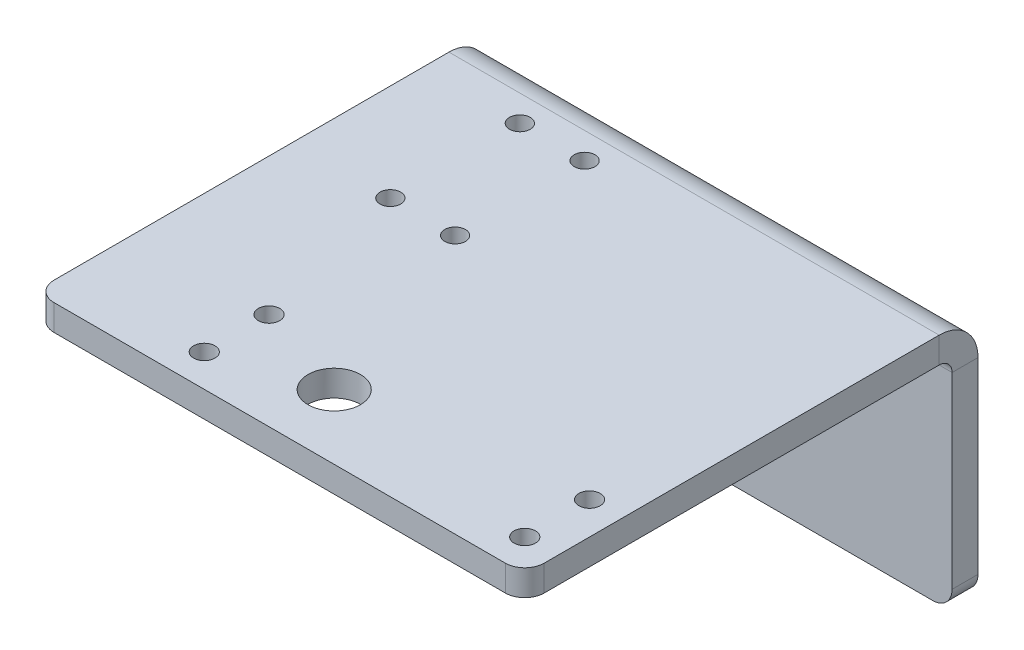
ISO-10303-21;
HEADER;
FILE_DESCRIPTION(('STEP AP214'),'2;1');
FILE_NAME('part.step','',(''),(''),'','','');
FILE_SCHEMA(('AUTOMOTIVE_DESIGN { 1 0 10303 214 1 1 1 1 }'));
ENDSEC;
DATA;
#1=APPLICATION_CONTEXT('core data for automotive mechanical design processes');
#2=APPLICATION_PROTOCOL_DEFINITION('international standard','automotive_design',2000,#1);
#3=PRODUCT_CONTEXT('',#1,'mechanical');
#4=PRODUCT('Part','Part','',(#3));
#5=PRODUCT_RELATED_PRODUCT_CATEGORY('part','',(#4));
#6=PRODUCT_DEFINITION_FORMATION('','',#4);
#7=PRODUCT_DEFINITION_CONTEXT('part definition',#1,'design');
#8=PRODUCT_DEFINITION('design','',#6,#7);
#9=PRODUCT_DEFINITION_SHAPE('','',#8);
#10=(LENGTH_UNIT() NAMED_UNIT(*) SI_UNIT(.MILLI.,.METRE.));
#11=(NAMED_UNIT(*) PLANE_ANGLE_UNIT() SI_UNIT($,.RADIAN.));
#12=(NAMED_UNIT(*) SI_UNIT($,.STERADIAN.) SOLID_ANGLE_UNIT());
#13=UNCERTAINTY_MEASURE_WITH_UNIT(LENGTH_MEASURE(1.E-05),#10,'distance_accuracy_value','');
#14=(GEOMETRIC_REPRESENTATION_CONTEXT(3) GLOBAL_UNCERTAINTY_ASSIGNED_CONTEXT((#13)) GLOBAL_UNIT_ASSIGNED_CONTEXT((#10,
#11,#12)) REPRESENTATION_CONTEXT('',''));
#15=CARTESIAN_POINT('',(0.,0.,0.));
#16=DIRECTION('',(0.,0.,1.));
#17=DIRECTION('',(1.,0.,0.));
#18=AXIS2_PLACEMENT_3D('',#15,#16,#17);
#19=CARTESIAN_POINT('',(75.71,0.,3.));
#20=DIRECTION('',(1.,0.,0.));
#21=DIRECTION('',(0.,1.,0.));
#22=AXIS2_PLACEMENT_3D('',#19,#20,#21);
#23=PLANE('',#22);
#24=DIRECTION('',(0.,1.,0.));
#25=VECTOR('',#24,1.);
#26=CARTESIAN_POINT('',(75.71,0.,3.));
#27=LINE('',#26,#25);
#28=CARTESIAN_POINT('',(75.71,-29.,3.));
#29=VERTEX_POINT('',#28);
#30=CARTESIAN_POINT('',(75.71,0.,3.));
#31=VERTEX_POINT('',#30);
#32=EDGE_CURVE('E214',#29,#31,#27,.T.);
#33=ORIENTED_EDGE('',*,*,#32,.F.);
#34=DIRECTION('',(0.,0.,1.));
#35=VECTOR('',#34,1.);
#36=CARTESIAN_POINT('',(75.71,-29.,3.));
#37=LINE('',#36,#35);
#38=CARTESIAN_POINT('',(75.71,-29.,-1.));
#39=VERTEX_POINT('',#38);
#40=EDGE_CURVE('E273',#29,#39,#37,.F.);
#41=ORIENTED_EDGE('',*,*,#40,.T.);
#42=DIRECTION('',(0.,1.,0.));
#43=VECTOR('',#42,1.);
#44=CARTESIAN_POINT('',(75.71,0.,-1.));
#45=LINE('',#44,#43);
#46=CARTESIAN_POINT('',(75.71,0.,-1.));
#47=VERTEX_POINT('',#46);
#48=EDGE_CURVE('E237',#39,#47,#45,.T.);
#49=ORIENTED_EDGE('',*,*,#48,.T.);
#50=DIRECTION('',(0.,0.,1.));
#51=VECTOR('',#50,1.);
#52=CARTESIAN_POINT('',(75.71,0.,3.));
#53=LINE('',#52,#51);
#54=EDGE_CURVE('E246',#47,#31,#53,.T.);
#55=ORIENTED_EDGE('',*,*,#54,.T.);
#56=EDGE_LOOP('',(#33,#41,#49,#55));
#57=FACE_BOUND('',#56,.T.);
#58=ADVANCED_FACE('F57',(#57),#23,.T.);
#59=CARTESIAN_POINT('',(0.,0.,3.));
#60=DIRECTION('',(-1.,0.,0.));
#61=DIRECTION('',(0.,-1.,0.));
#62=AXIS2_PLACEMENT_3D('',#59,#60,#61);
#63=PLANE('',#62);
#64=DIRECTION('',(0.,1.,0.));
#65=VECTOR('',#64,1.);
#66=CARTESIAN_POINT('',(0.,0.,-1.));
#67=LINE('',#66,#65);
#68=CARTESIAN_POINT('',(0.,0.,-1.));
#69=VERTEX_POINT('',#68);
#70=CARTESIAN_POINT('',(0.,-29.,-1.));
#71=VERTEX_POINT('',#70);
#72=EDGE_CURVE('E231',#69,#71,#67,.F.);
#73=ORIENTED_EDGE('',*,*,#72,.T.);
#74=DIRECTION('',(0.,0.,1.));
#75=VECTOR('',#74,1.);
#76=CARTESIAN_POINT('',(0.,-29.,3.));
#77=LINE('',#76,#75);
#78=CARTESIAN_POINT('',(0.,-29.,3.));
#79=VERTEX_POINT('',#78);
#80=EDGE_CURVE('E279',#71,#79,#77,.T.);
#81=ORIENTED_EDGE('',*,*,#80,.T.);
#82=DIRECTION('',(0.,-1.,0.));
#83=VECTOR('',#82,1.);
#84=CARTESIAN_POINT('',(0.,0.,3.));
#85=LINE('',#84,#83);
#86=CARTESIAN_POINT('',(0.,0.,3.));
#87=VERTEX_POINT('',#86);
#88=EDGE_CURVE('E208',#87,#79,#85,.T.);
#89=ORIENTED_EDGE('',*,*,#88,.F.);
#90=DIRECTION('',(0.,0.,1.));
#91=VECTOR('',#90,1.);
#92=CARTESIAN_POINT('',(0.,0.,3.));
#93=LINE('',#92,#91);
#94=EDGE_CURVE('E225',#69,#87,#93,.T.);
#95=ORIENTED_EDGE('',*,*,#94,.F.);
#96=EDGE_LOOP('',(#73,#81,#89,#95));
#97=FACE_BOUND('',#96,.T.);
#98=ADVANCED_FACE('F329',(#97),#63,.T.);
#99=CARTESIAN_POINT('',(16.,-25.0000000000001,3.));
#100=DIRECTION('',(0.,0.,1.));
#101=DIRECTION('',(1.,0.,0.));
#102=AXIS2_PLACEMENT_3D('',#99,#100,#101);
#103=CYLINDRICAL_SURFACE('',#102,1.6);
#104=CARTESIAN_POINT('',(16.,-25.0000000000001,3.));
#105=DIRECTION('',(0.,0.,1.));
#106=DIRECTION('',(1.,0.,0.));
#107=AXIS2_PLACEMENT_3D('',#104,#105,#106);
#108=CIRCLE('',#107,1.6);
#109=CARTESIAN_POINT('',(17.6,-25.0000000000001,3.));
#110=VERTEX_POINT('',#109);
#111=EDGE_CURVE('E201',#110,#110,#108,.T.);
#112=ORIENTED_EDGE('',*,*,#111,.T.);
#113=EDGE_LOOP('',(#112));
#114=FACE_BOUND('',#113,.T.);
#115=CARTESIAN_POINT('',(16.,-25.0000000000001,-1.));
#116=DIRECTION('',(0.,0.,1.));
#117=DIRECTION('',(1.,0.,0.));
#118=AXIS2_PLACEMENT_3D('',#115,#116,#117);
#119=CIRCLE('',#118,1.6);
#120=CARTESIAN_POINT('',(17.6,-25.0000000000001,-1.));
#121=VERTEX_POINT('',#120);
#122=EDGE_CURVE('E196',#121,#121,#119,.T.);
#123=ORIENTED_EDGE('',*,*,#122,.F.);
#124=EDGE_LOOP('',(#123));
#125=FACE_BOUND('',#124,.T.);
#126=ADVANCED_FACE('F355',(#114,#125),#103,.F.);
#127=CARTESIAN_POINT('',(36.,-5.,3.));
#128=DIRECTION('',(0.,0.,1.));
#129=DIRECTION('',(1.,0.,0.));
#130=AXIS2_PLACEMENT_3D('',#127,#128,#129);
#131=CYLINDRICAL_SURFACE('',#130,1.60000000000001);
#132=CARTESIAN_POINT('',(36.,-5.,3.));
#133=DIRECTION('',(0.,0.,1.));
#134=DIRECTION('',(1.,0.,0.));
#135=AXIS2_PLACEMENT_3D('',#132,#133,#134);
#136=CIRCLE('',#135,1.60000000000001);
#137=CARTESIAN_POINT('',(37.6,-5.,3.));
#138=VERTEX_POINT('',#137);
#139=EDGE_CURVE('E204',#138,#138,#136,.T.);
#140=ORIENTED_EDGE('',*,*,#139,.T.);
#141=EDGE_LOOP('',(#140));
#142=FACE_BOUND('',#141,.T.);
#143=CARTESIAN_POINT('',(36.,-5.,-1.));
#144=DIRECTION('',(0.,0.,1.));
#145=DIRECTION('',(1.,0.,0.));
#146=AXIS2_PLACEMENT_3D('',#143,#144,#145);
#147=CIRCLE('',#146,1.60000000000001);
#148=CARTESIAN_POINT('',(37.6,-5.,-1.));
#149=VERTEX_POINT('',#148);
#150=EDGE_CURVE('E228',#149,#149,#147,.T.);
#151=ORIENTED_EDGE('',*,*,#150,.F.);
#152=EDGE_LOOP('',(#151));
#153=FACE_BOUND('',#152,.T.);
#154=ADVANCED_FACE('F362',(#142,#153),#131,.F.);
#155=CARTESIAN_POINT('',(0.,-32.,3.));
#156=DIRECTION('',(0.,-1.,0.));
#157=DIRECTION('',(1.,0.,0.));
#158=AXIS2_PLACEMENT_3D('',#155,#156,#157);
#159=PLANE('',#158);
#160=DIRECTION('',(1.,0.,0.));
#161=VECTOR('',#160,1.);
#162=CARTESIAN_POINT('',(0.,-32.,-1.));
#163=LINE('',#162,#161);
#164=CARTESIAN_POINT('',(3.,-32.,-1.));
#165=VERTEX_POINT('',#164);
#166=CARTESIAN_POINT('',(72.71,-32.,-1.));
#167=VERTEX_POINT('',#166);
#168=EDGE_CURVE('E234',#165,#167,#163,.T.);
#169=ORIENTED_EDGE('',*,*,#168,.T.);
#170=DIRECTION('',(0.,0.,1.));
#171=VECTOR('',#170,1.);
#172=CARTESIAN_POINT('',(72.71,-32.,3.));
#173=LINE('',#172,#171);
#174=CARTESIAN_POINT('',(72.71,-32.,3.));
#175=VERTEX_POINT('',#174);
#176=EDGE_CURVE('E266',#167,#175,#173,.T.);
#177=ORIENTED_EDGE('',*,*,#176,.T.);
#178=DIRECTION('',(1.,0.,0.));
#179=VECTOR('',#178,1.);
#180=CARTESIAN_POINT('',(0.,-32.,3.));
#181=LINE('',#180,#179);
#182=CARTESIAN_POINT('',(3.,-32.,3.));
#183=VERTEX_POINT('',#182);
#184=EDGE_CURVE('E211',#183,#175,#181,.T.);
#185=ORIENTED_EDGE('',*,*,#184,.F.);
#186=DIRECTION('',(0.,0.,1.));
#187=VECTOR('',#186,1.);
#188=CARTESIAN_POINT('',(3.,-32.,3.));
#189=LINE('',#188,#187);
#190=EDGE_CURVE('E249',#183,#165,#189,.F.);
#191=ORIENTED_EDGE('',*,*,#190,.T.);
#192=EDGE_LOOP('',(#169,#177,#185,#191));
#193=FACE_BOUND('',#192,.T.);
#194=ADVANCED_FACE('F338',(#193),#159,.T.);
#195=CARTESIAN_POINT('',(16.,-5.00000000000014,3.));
#196=DIRECTION('',(0.,0.,1.));
#197=DIRECTION('',(1.,0.,0.));
#198=AXIS2_PLACEMENT_3D('',#195,#196,#197);
#199=CYLINDRICAL_SURFACE('',#198,1.60000000000001);
#200=CARTESIAN_POINT('',(16.,-5.00000000000014,3.));
#201=DIRECTION('',(0.,0.,1.));
#202=DIRECTION('',(1.,0.,0.));
#203=AXIS2_PLACEMENT_3D('',#200,#201,#202);
#204=CIRCLE('',#203,1.60000000000001);
#205=CARTESIAN_POINT('',(17.6,-5.00000000000014,3.));
#206=VERTEX_POINT('',#205);
#207=EDGE_CURVE('E219',#206,#206,#204,.T.);
#208=ORIENTED_EDGE('',*,*,#207,.T.);
#209=EDGE_LOOP('',(#208));
#210=FACE_BOUND('',#209,.T.);
#211=CARTESIAN_POINT('',(16.,-5.00000000000014,-1.));
#212=DIRECTION('',(0.,0.,1.));
#213=DIRECTION('',(1.,0.,0.));
#214=AXIS2_PLACEMENT_3D('',#211,#212,#213);
#215=CIRCLE('',#214,1.60000000000001);
#216=CARTESIAN_POINT('',(17.6,-5.00000000000014,-1.));
#217=VERTEX_POINT('',#216);
#218=EDGE_CURVE('E236',#217,#217,#215,.T.);
#219=ORIENTED_EDGE('',*,*,#218,.F.);
#220=EDGE_LOOP('',(#219));
#221=FACE_BOUND('',#220,.T.);
#222=ADVANCED_FACE('F361',(#210,#221),#199,.F.);
#223=CARTESIAN_POINT('',(36.,-25.,3.));
#224=DIRECTION('',(0.,0.,1.));
#225=DIRECTION('',(1.,0.,0.));
#226=AXIS2_PLACEMENT_3D('',#223,#224,#225);
#227=CYLINDRICAL_SURFACE('',#226,1.6);
#228=CARTESIAN_POINT('',(36.,-25.,3.));
#229=DIRECTION('',(0.,0.,1.));
#230=DIRECTION('',(1.,0.,0.));
#231=AXIS2_PLACEMENT_3D('',#228,#229,#230);
#232=CIRCLE('',#231,1.6);
#233=CARTESIAN_POINT('',(37.6,-25.,3.));
#234=VERTEX_POINT('',#233);
#235=EDGE_CURVE('E222',#234,#234,#232,.T.);
#236=ORIENTED_EDGE('',*,*,#235,.T.);
#237=EDGE_LOOP('',(#236));
#238=FACE_BOUND('',#237,.T.);
#239=CARTESIAN_POINT('',(36.,-25.,-1.));
#240=DIRECTION('',(0.,0.,1.));
#241=DIRECTION('',(1.,0.,0.));
#242=AXIS2_PLACEMENT_3D('',#239,#240,#241);
#243=CIRCLE('',#242,1.6);
#244=CARTESIAN_POINT('',(37.6,-25.,-1.));
#245=VERTEX_POINT('',#244);
#246=EDGE_CURVE('E205',#245,#245,#243,.T.);
#247=ORIENTED_EDGE('',*,*,#246,.F.);
#248=EDGE_LOOP('',(#247));
#249=FACE_BOUND('',#248,.T.);
#250=ADVANCED_FACE('F365',(#238,#249),#227,.F.);
#251=CARTESIAN_POINT('',(0.,0.,3.));
#252=DIRECTION('',(0.,0.,1.));
#253=DIRECTION('',(1.,0.,0.));
#254=AXIS2_PLACEMENT_3D('',#251,#252,#253);
#255=PLANE('',#254);
#256=ORIENTED_EDGE('',*,*,#111,.F.);
#257=EDGE_LOOP('',(#256));
#258=FACE_BOUND('',#257,.T.);
#259=ORIENTED_EDGE('',*,*,#139,.F.);
#260=EDGE_LOOP('',(#259));
#261=FACE_BOUND('',#260,.T.);
#262=ORIENTED_EDGE('',*,*,#184,.T.);
#263=CARTESIAN_POINT('',(72.71,-29.,3.));
#264=DIRECTION('',(0.,0.,1.));
#265=DIRECTION('',(1.,0.,0.));
#266=AXIS2_PLACEMENT_3D('',#263,#264,#265);
#267=CIRCLE('',#266,3.);
#268=EDGE_CURVE('E271',#175,#29,#267,.T.);
#269=ORIENTED_EDGE('',*,*,#268,.T.);
#270=ORIENTED_EDGE('',*,*,#32,.T.);
#271=DIRECTION('',(-1.,0.,0.));
#272=VECTOR('',#271,1.);
#273=CARTESIAN_POINT('',(0.,0.,3.));
#274=LINE('',#273,#272);
#275=EDGE_CURVE('E216',#31,#87,#274,.T.);
#276=ORIENTED_EDGE('',*,*,#275,.T.);
#277=ORIENTED_EDGE('',*,*,#88,.T.);
#278=CARTESIAN_POINT('',(3.,-29.,3.));
#279=DIRECTION('',(0.,0.,1.));
#280=DIRECTION('',(1.,0.,0.));
#281=AXIS2_PLACEMENT_3D('',#278,#279,#280);
#282=CIRCLE('',#281,3.);
#283=EDGE_CURVE('E269',#79,#183,#282,.T.);
#284=ORIENTED_EDGE('',*,*,#283,.T.);
#285=EDGE_LOOP('',(#262,#269,#270,#276,#277,#284));
#286=FACE_BOUND('',#285,.T.);
#287=ORIENTED_EDGE('',*,*,#207,.F.);
#288=EDGE_LOOP('',(#287));
#289=FACE_BOUND('',#288,.T.);
#290=ORIENTED_EDGE('',*,*,#235,.F.);
#291=EDGE_LOOP('',(#290));
#292=FACE_BOUND('',#291,.T.);
#293=ADVANCED_FACE('F331',(#258,#261,#286,#289,#292),#255,.T.);
#294=CARTESIAN_POINT('',(0.,0.,-1.));
#295=DIRECTION('',(0.,0.,1.));
#296=DIRECTION('',(1.,0.,0.));
#297=AXIS2_PLACEMENT_3D('',#294,#295,#296);
#298=PLANE('',#297);
#299=ORIENTED_EDGE('',*,*,#122,.T.);
#300=EDGE_LOOP('',(#299));
#301=FACE_BOUND('',#300,.T.);
#302=ORIENTED_EDGE('',*,*,#150,.T.);
#303=EDGE_LOOP('',(#302));
#304=FACE_BOUND('',#303,.T.);
#305=ORIENTED_EDGE('',*,*,#48,.F.);
#306=CARTESIAN_POINT('',(72.71,-29.,-1.));
#307=DIRECTION('',(0.,0.,1.));
#308=DIRECTION('',(1.,0.,0.));
#309=AXIS2_PLACEMENT_3D('',#306,#307,#308);
#310=CIRCLE('',#309,3.);
#311=EDGE_CURVE('E277',#39,#167,#310,.F.);
#312=ORIENTED_EDGE('',*,*,#311,.T.);
#313=ORIENTED_EDGE('',*,*,#168,.F.);
#314=CARTESIAN_POINT('',(3.,-29.,-1.));
#315=DIRECTION('',(0.,0.,1.));
#316=DIRECTION('',(1.,0.,0.));
#317=AXIS2_PLACEMENT_3D('',#314,#315,#316);
#318=CIRCLE('',#317,3.);
#319=EDGE_CURVE('E275',#165,#71,#318,.F.);
#320=ORIENTED_EDGE('',*,*,#319,.T.);
#321=ORIENTED_EDGE('',*,*,#72,.F.);
#322=DIRECTION('',(1.,0.,0.));
#323=VECTOR('',#322,1.);
#324=CARTESIAN_POINT('',(0.,0.,-1.));
#325=LINE('',#324,#323);
#326=EDGE_CURVE('E158',#47,#69,#325,.F.);
#327=ORIENTED_EDGE('',*,*,#326,.F.);
#328=EDGE_LOOP('',(#305,#312,#313,#320,#321,#327));
#329=FACE_BOUND('',#328,.T.);
#330=ORIENTED_EDGE('',*,*,#218,.T.);
#331=EDGE_LOOP('',(#330));
#332=FACE_BOUND('',#331,.T.);
#333=ORIENTED_EDGE('',*,*,#246,.T.);
#334=EDGE_LOOP('',(#333));
#335=FACE_BOUND('',#334,.T.);
#336=ADVANCED_FACE('F322',(#301,#304,#329,#332,#335),#298,.F.);
#337=CARTESIAN_POINT('',(75.71,0.,5.));
#338=DIRECTION('',(1.,0.,0.));
#339=DIRECTION('',(0.,0.,-1.));
#340=AXIS2_PLACEMENT_3D('',#337,#338,#339);
#341=PLANE('',#340);
#342=DIRECTION('',(0.,-1.,0.));
#343=VECTOR('',#342,1.);
#344=CARTESIAN_POINT('',(75.71,6.,4.99999999999998));
#345=LINE('',#344,#343);
#346=CARTESIAN_POINT('',(75.71,2.,4.99999999999999));
#347=VERTEX_POINT('',#346);
#348=CARTESIAN_POINT('',(75.71,6.,4.99999999999998));
#349=VERTEX_POINT('',#348);
#350=EDGE_CURVE('E192',#347,#349,#345,.F.);
#351=ORIENTED_EDGE('',*,*,#350,.F.);
#352=CARTESIAN_POINT('',(75.71,0.,5.));
#353=DIRECTION('',(-1.,0.,0.));
#354=DIRECTION('',(0.,0.,1.));
#355=AXIS2_PLACEMENT_3D('',#352,#353,#354);
#356=CIRCLE('',#355,2.);
#357=EDGE_CURVE('E162',#31,#347,#356,.F.);
#358=ORIENTED_EDGE('',*,*,#357,.F.);
#359=ORIENTED_EDGE('',*,*,#54,.F.);
#360=CARTESIAN_POINT('',(75.71,0.,5.));
#361=DIRECTION('',(-1.,0.,0.));
#362=DIRECTION('',(0.,0.,1.));
#363=AXIS2_PLACEMENT_3D('',#360,#361,#362);
#364=CIRCLE('',#363,6.);
#365=EDGE_CURVE('E161',#47,#349,#364,.F.);
#366=ORIENTED_EDGE('',*,*,#365,.T.);
#367=EDGE_LOOP('',(#351,#358,#359,#366));
#368=FACE_BOUND('',#367,.T.);
#369=ADVANCED_FACE('F315',(#368),#341,.T.);
#370=CARTESIAN_POINT('',(0.,0.,5.));
#371=DIRECTION('',(1.,0.,0.));
#372=DIRECTION('',(0.,0.,-1.));
#373=AXIS2_PLACEMENT_3D('',#370,#371,#372);
#374=PLANE('',#373);
#375=CARTESIAN_POINT('',(0.,0.,5.));
#376=DIRECTION('',(-1.,0.,0.));
#377=DIRECTION('',(0.,0.,1.));
#378=AXIS2_PLACEMENT_3D('',#375,#376,#377);
#379=CIRCLE('',#378,2.);
#380=CARTESIAN_POINT('',(0.,2.,4.99999999999999));
#381=VERTEX_POINT('',#380);
#382=EDGE_CURVE('E169',#381,#87,#379,.T.);
#383=ORIENTED_EDGE('',*,*,#382,.F.);
#384=DIRECTION('',(0.,-1.,0.));
#385=VECTOR('',#384,1.);
#386=CARTESIAN_POINT('',(0.,2.,4.99999999999999));
#387=LINE('',#386,#385);
#388=CARTESIAN_POINT('',(0.,6.,4.99999999999998));
#389=VERTEX_POINT('',#388);
#390=EDGE_CURVE('E166',#381,#389,#387,.F.);
#391=ORIENTED_EDGE('',*,*,#390,.T.);
#392=CARTESIAN_POINT('',(0.,0.,5.));
#393=DIRECTION('',(-1.,0.,0.));
#394=DIRECTION('',(0.,0.,1.));
#395=AXIS2_PLACEMENT_3D('',#392,#393,#394);
#396=CIRCLE('',#395,6.);
#397=EDGE_CURVE('E150',#389,#69,#396,.T.);
#398=ORIENTED_EDGE('',*,*,#397,.T.);
#399=ORIENTED_EDGE('',*,*,#94,.T.);
#400=EDGE_LOOP('',(#383,#391,#398,#399));
#401=FACE_BOUND('',#400,.T.);
#402=ADVANCED_FACE('F167',(#401),#374,.F.);
#403=CARTESIAN_POINT('',(0.,0.,5.));
#404=DIRECTION('',(-1.,0.,0.));
#405=DIRECTION('',(0.,1.,0.));
#406=AXIS2_PLACEMENT_3D('',#403,#404,#405);
#407=CYLINDRICAL_SURFACE('',#406,6.);
#408=ORIENTED_EDGE('',*,*,#326,.T.);
#409=ORIENTED_EDGE('',*,*,#397,.F.);
#410=DIRECTION('',(-1.,0.,0.));
#411=VECTOR('',#410,1.);
#412=CARTESIAN_POINT('',(75.71,6.,4.99999999999998));
#413=LINE('',#412,#411);
#414=EDGE_CURVE('E155',#389,#349,#413,.F.);
#415=ORIENTED_EDGE('',*,*,#414,.T.);
#416=ORIENTED_EDGE('',*,*,#365,.F.);
#417=EDGE_LOOP('',(#408,#409,#415,#416));
#418=FACE_BOUND('',#417,.T.);
#419=ADVANCED_FACE('F152',(#418),#407,.T.);
#420=CARTESIAN_POINT('',(0.,0.,5.));
#421=DIRECTION('',(-1.,0.,0.));
#422=DIRECTION('',(0.,1.,0.));
#423=AXIS2_PLACEMENT_3D('',#420,#421,#422);
#424=CYLINDRICAL_SURFACE('',#423,2.);
#425=ORIENTED_EDGE('',*,*,#275,.F.);
#426=ORIENTED_EDGE('',*,*,#357,.T.);
#427=DIRECTION('',(-1.,0.,0.));
#428=VECTOR('',#427,1.);
#429=CARTESIAN_POINT('',(75.71,2.,4.99999999999999));
#430=LINE('',#429,#428);
#431=EDGE_CURVE('E171',#347,#381,#430,.T.);
#432=ORIENTED_EDGE('',*,*,#431,.T.);
#433=ORIENTED_EDGE('',*,*,#382,.T.);
#434=EDGE_LOOP('',(#425,#426,#432,#433));
#435=FACE_BOUND('',#434,.T.);
#436=ADVANCED_FACE('F311',(#435),#424,.F.);
#437=CARTESIAN_POINT('',(0.,6.00000000000022,69.));
#438=DIRECTION('',(1.,0.,0.));
#439=DIRECTION('',(0.,0.,-1.));
#440=AXIS2_PLACEMENT_3D('',#437,#438,#439);
#441=PLANE('',#440);
#442=DIRECTION('',(0.,0.,-1.));
#443=VECTOR('',#442,1.);
#444=CARTESIAN_POINT('',(0.,2.00000000000022,69.));
#445=LINE('',#444,#443);
#446=CARTESIAN_POINT('',(0.,2.00000000000021,66.));
#447=VERTEX_POINT('',#446);
#448=EDGE_CURVE('E177',#381,#447,#445,.F.);
#449=ORIENTED_EDGE('',*,*,#448,.T.);
#450=DIRECTION('',(0.,-1.,0.));
#451=VECTOR('',#450,1.);
#452=CARTESIAN_POINT('',(0.,6.00000000000021,66.));
#453=LINE('',#452,#451);
#454=CARTESIAN_POINT('',(0.,6.00000000000021,66.));
#455=VERTEX_POINT('',#454);
#456=EDGE_CURVE('E80',#447,#455,#453,.F.);
#457=ORIENTED_EDGE('',*,*,#456,.T.);
#458=DIRECTION('',(0.,0.,1.));
#459=VECTOR('',#458,1.);
#460=CARTESIAN_POINT('',(0.,5.99999999999998,0.));
#461=LINE('',#460,#459);
#462=EDGE_CURVE('E174',#389,#455,#461,.T.);
#463=ORIENTED_EDGE('',*,*,#462,.F.);
#464=ORIENTED_EDGE('',*,*,#390,.F.);
#465=EDGE_LOOP('',(#449,#457,#463,#464));
#466=FACE_BOUND('',#465,.T.);
#467=ADVANCED_FACE('F179',(#466),#441,.F.);
#468=CARTESIAN_POINT('',(75.71,5.99999999999999,2.99999999999999));
#469=DIRECTION('',(-1.,0.,0.));
#470=DIRECTION('',(0.,0.,1.));
#471=AXIS2_PLACEMENT_3D('',#468,#469,#470);
#472=PLANE('',#471);
#473=DIRECTION('',(0.,0.,-1.));
#474=VECTOR('',#473,1.);
#475=CARTESIAN_POINT('',(75.71,5.99999999999998,0.));
#476=LINE('',#475,#474);
#477=CARTESIAN_POINT('',(75.71,6.00000000000021,66.));
#478=VERTEX_POINT('',#477);
#479=EDGE_CURVE('E176',#478,#349,#476,.T.);
#480=ORIENTED_EDGE('',*,*,#479,.F.);
#481=DIRECTION('',(0.,-1.,0.));
#482=VECTOR('',#481,1.);
#483=CARTESIAN_POINT('',(75.71,6.00000000000021,66.));
#484=LINE('',#483,#482);
#485=CARTESIAN_POINT('',(75.71,2.00000000000021,66.));
#486=VERTEX_POINT('',#485);
#487=EDGE_CURVE('E13',#478,#486,#484,.T.);
#488=ORIENTED_EDGE('',*,*,#487,.T.);
#489=DIRECTION('',(0.,0.,1.));
#490=VECTOR('',#489,1.);
#491=CARTESIAN_POINT('',(75.71,1.99999999999999,3.));
#492=LINE('',#491,#490);
#493=EDGE_CURVE('E181',#486,#347,#492,.F.);
#494=ORIENTED_EDGE('',*,*,#493,.T.);
#495=ORIENTED_EDGE('',*,*,#350,.T.);
#496=EDGE_LOOP('',(#480,#488,#494,#495));
#497=FACE_BOUND('',#496,.T.);
#498=ADVANCED_FACE('F307',(#497),#472,.F.);
#499=CARTESIAN_POINT('',(0.,5.99999999999998,0.));
#500=DIRECTION('',(0.,-1.,0.));
#501=DIRECTION('',(0.,0.,-1.));
#502=AXIS2_PLACEMENT_3D('',#499,#500,#501);
#503=PLANE('',#502);
#504=CARTESIAN_POINT('',(70.71,6.00000000000017,54.));
#505=DIRECTION('',(0.,1.,0.));
#506=DIRECTION('',(0.,0.,1.));
#507=AXIS2_PLACEMENT_3D('',#504,#505,#506);
#508=CIRCLE('',#507,1.64999999999998);
#509=CARTESIAN_POINT('',(70.71,6.00000000000018,55.65));
#510=VERTEX_POINT('',#509);
#511=EDGE_CURVE('E682',#510,#510,#508,.T.);
#512=ORIENTED_EDGE('',*,*,#511,.F.);
#513=EDGE_LOOP('',(#512));
#514=FACE_BOUND('',#513,.T.);
#515=CARTESIAN_POINT('',(70.71,6.0000000000002,64.));
#516=DIRECTION('',(0.,1.,0.));
#517=DIRECTION('',(0.,0.,1.));
#518=AXIS2_PLACEMENT_3D('',#515,#516,#517);
#519=CIRCLE('',#518,1.64999999999998);
#520=CARTESIAN_POINT('',(70.71,6.0000000000002,65.65));
#521=VERTEX_POINT('',#520);
#522=EDGE_CURVE('E684',#521,#521,#519,.T.);
#523=ORIENTED_EDGE('',*,*,#522,.F.);
#524=EDGE_LOOP('',(#523));
#525=FACE_BOUND('',#524,.T.);
#526=CARTESIAN_POINT('',(21.21,6.00000000000024,64.));
#527=DIRECTION('',(0.,1.,0.));
#528=DIRECTION('',(0.,0.,1.));
#529=AXIS2_PLACEMENT_3D('',#526,#527,#528);
#530=CIRCLE('',#529,1.64999999999999);
#531=CARTESIAN_POINT('',(21.21,6.00000000000025,65.65));
#532=VERTEX_POINT('',#531);
#533=EDGE_CURVE('E692',#532,#532,#530,.T.);
#534=ORIENTED_EDGE('',*,*,#533,.F.);
#535=EDGE_LOOP('',(#534));
#536=FACE_BOUND('',#535,.T.);
#537=CARTESIAN_POINT('',(21.21,6.0000000000002,54.));
#538=DIRECTION('',(0.,1.,0.));
#539=DIRECTION('',(0.,0.,1.));
#540=AXIS2_PLACEMENT_3D('',#537,#538,#539);
#541=CIRCLE('',#540,1.64999999999999);
#542=CARTESIAN_POINT('',(21.21,6.00000000000021,55.65));
#543=VERTEX_POINT('',#542);
#544=EDGE_CURVE('E698',#543,#543,#541,.T.);
#545=ORIENTED_EDGE('',*,*,#544,.F.);
#546=EDGE_LOOP('',(#545));
#547=FACE_BOUND('',#546,.T.);
#548=CARTESIAN_POINT('',(36.28,6.00000000000019,59.));
#549=DIRECTION('',(0.,1.,0.));
#550=DIRECTION('',(0.,0.,1.));
#551=AXIS2_PLACEMENT_3D('',#548,#549,#550);
#552=CIRCLE('',#551,4.05);
#553=CARTESIAN_POINT('',(36.28,6.0000000000002,63.05));
#554=VERTEX_POINT('',#553);
#555=EDGE_CURVE('E711',#554,#554,#552,.T.);
#556=ORIENTED_EDGE('',*,*,#555,.F.);
#557=EDGE_LOOP('',(#556));
#558=FACE_BOUND('',#557,.T.);
#559=CARTESIAN_POINT('',(15.,6.00000000000001,9.05000000000002));
#560=DIRECTION('',(0.,1.,0.));
#561=DIRECTION('',(0.,0.,1.));
#562=AXIS2_PLACEMENT_3D('',#559,#560,#561);
#563=CIRCLE('',#562,1.6);
#564=CARTESIAN_POINT('',(15.,6.00000000000002,10.65));
#565=VERTEX_POINT('',#564);
#566=EDGE_CURVE('E708',#565,#565,#563,.T.);
#567=ORIENTED_EDGE('',*,*,#566,.F.);
#568=EDGE_LOOP('',(#567));
#569=FACE_BOUND('',#568,.T.);
#570=CARTESIAN_POINT('',(25.,6.00000000000001,9.05000000000002));
#571=DIRECTION('',(0.,1.,0.));
#572=DIRECTION('',(0.,0.,1.));
#573=AXIS2_PLACEMENT_3D('',#570,#571,#572);
#574=CIRCLE('',#573,1.6);
#575=CARTESIAN_POINT('',(25.,6.00000000000002,10.65));
#576=VERTEX_POINT('',#575);
#577=EDGE_CURVE('E705',#576,#576,#574,.T.);
#578=ORIENTED_EDGE('',*,*,#577,.F.);
#579=EDGE_LOOP('',(#578));
#580=FACE_BOUND('',#579,.T.);
#581=CARTESIAN_POINT('',(25.,6.00000000000008,29.05));
#582=DIRECTION('',(0.,1.,0.));
#583=DIRECTION('',(0.,0.,1.));
#584=AXIS2_PLACEMENT_3D('',#581,#582,#583);
#585=CIRCLE('',#584,1.6);
#586=CARTESIAN_POINT('',(25.,6.00000000000009,30.65));
#587=VERTEX_POINT('',#586);
#588=EDGE_CURVE('E704',#587,#587,#585,.T.);
#589=ORIENTED_EDGE('',*,*,#588,.F.);
#590=EDGE_LOOP('',(#589));
#591=FACE_BOUND('',#590,.T.);
#592=CARTESIAN_POINT('',(15.,6.00000000000008,29.05));
#593=DIRECTION('',(0.,1.,0.));
#594=DIRECTION('',(0.,0.,1.));
#595=AXIS2_PLACEMENT_3D('',#592,#593,#594);
#596=CIRCLE('',#595,1.6);
#597=CARTESIAN_POINT('',(15.,6.00000000000009,30.65));
#598=VERTEX_POINT('',#597);
#599=EDGE_CURVE('E254',#598,#598,#596,.T.);
#600=ORIENTED_EDGE('',*,*,#599,.F.);
#601=EDGE_LOOP('',(#600));
#602=FACE_BOUND('',#601,.T.);
#603=ORIENTED_EDGE('',*,*,#462,.T.);
#604=CARTESIAN_POINT('',(3.,6.00000000000021,66.));
#605=DIRECTION('',(0.,-1.,0.));
#606=DIRECTION('',(0.,0.,-1.));
#607=AXIS2_PLACEMENT_3D('',#604,#605,#606);
#608=CIRCLE('',#607,3.);
#609=CARTESIAN_POINT('',(3.,6.00000000000022,69.));
#610=VERTEX_POINT('',#609);
#611=EDGE_CURVE('E65',#455,#610,#608,.F.);
#612=ORIENTED_EDGE('',*,*,#611,.T.);
#613=DIRECTION('',(1.,0.,0.));
#614=VECTOR('',#613,1.);
#615=CARTESIAN_POINT('',(0.,6.00000000000022,69.));
#616=LINE('',#615,#614);
#617=CARTESIAN_POINT('',(72.71,6.00000000000022,69.));
#618=VERTEX_POINT('',#617);
#619=EDGE_CURVE('E180',#610,#618,#616,.T.);
#620=ORIENTED_EDGE('',*,*,#619,.T.);
#621=CARTESIAN_POINT('',(72.71,6.00000000000021,66.));
#622=DIRECTION('',(0.,-1.,0.));
#623=DIRECTION('',(0.,0.,-1.));
#624=AXIS2_PLACEMENT_3D('',#621,#622,#623);
#625=CIRCLE('',#624,3.);
#626=EDGE_CURVE('E72',#618,#478,#625,.F.);
#627=ORIENTED_EDGE('',*,*,#626,.T.);
#628=ORIENTED_EDGE('',*,*,#479,.T.);
#629=ORIENTED_EDGE('',*,*,#414,.F.);
#630=EDGE_LOOP('',(#603,#612,#620,#627,#628,#629));
#631=FACE_BOUND('',#630,.T.);
#632=ADVANCED_FACE('F173',(#514,#525,#536,#547,#558,#569,#580,#591,#602,#631),#503,.F.);
#633=CARTESIAN_POINT('',(0.,1.99999999999998,0.));
#634=DIRECTION('',(0.,-1.,0.));
#635=DIRECTION('',(0.,0.,-1.));
#636=AXIS2_PLACEMENT_3D('',#633,#634,#635);
#637=PLANE('',#636);
#638=CARTESIAN_POINT('',(70.71,2.00000000000017,54.));
#639=DIRECTION('',(0.,-1.,0.));
#640=DIRECTION('',(0.,0.,-1.));
#641=AXIS2_PLACEMENT_3D('',#638,#639,#640);
#642=CIRCLE('',#641,1.64999999999998);
#643=CARTESIAN_POINT('',(70.71,2.00000000000017,52.35));
#644=VERTEX_POINT('',#643);
#645=EDGE_CURVE('E679',#644,#644,#642,.T.);
#646=ORIENTED_EDGE('',*,*,#645,.F.);
#647=EDGE_LOOP('',(#646));
#648=FACE_BOUND('',#647,.T.);
#649=CARTESIAN_POINT('',(70.71,2.00000000000021,64.));
#650=DIRECTION('',(0.,-1.,0.));
#651=DIRECTION('',(0.,0.,-1.));
#652=AXIS2_PLACEMENT_3D('',#649,#650,#651);
#653=CIRCLE('',#652,1.64999999999998);
#654=CARTESIAN_POINT('',(70.71,2.0000000000002,62.35));
#655=VERTEX_POINT('',#654);
#656=EDGE_CURVE('E689',#655,#655,#653,.T.);
#657=ORIENTED_EDGE('',*,*,#656,.F.);
#658=EDGE_LOOP('',(#657));
#659=FACE_BOUND('',#658,.T.);
#660=CARTESIAN_POINT('',(21.21,2.00000000000021,64.));
#661=DIRECTION('',(0.,-1.,0.));
#662=DIRECTION('',(0.,0.,-1.));
#663=AXIS2_PLACEMENT_3D('',#660,#661,#662);
#664=CIRCLE('',#663,1.64999999999999);
#665=CARTESIAN_POINT('',(21.21,2.0000000000002,62.35));
#666=VERTEX_POINT('',#665);
#667=EDGE_CURVE('E695',#666,#666,#664,.T.);
#668=ORIENTED_EDGE('',*,*,#667,.F.);
#669=EDGE_LOOP('',(#668));
#670=FACE_BOUND('',#669,.T.);
#671=CARTESIAN_POINT('',(21.21,2.00000000000017,54.));
#672=DIRECTION('',(0.,-1.,0.));
#673=DIRECTION('',(0.,0.,-1.));
#674=AXIS2_PLACEMENT_3D('',#671,#672,#673);
#675=CIRCLE('',#674,1.64999999999999);
#676=CARTESIAN_POINT('',(21.21,2.00000000000017,52.35));
#677=VERTEX_POINT('',#676);
#678=EDGE_CURVE('E701',#677,#677,#675,.T.);
#679=ORIENTED_EDGE('',*,*,#678,.F.);
#680=EDGE_LOOP('',(#679));
#681=FACE_BOUND('',#680,.T.);
#682=CARTESIAN_POINT('',(36.28,2.00000000000019,59.));
#683=DIRECTION('',(0.,-1.,0.));
#684=DIRECTION('',(0.,0.,-1.));
#685=AXIS2_PLACEMENT_3D('',#682,#683,#684);
#686=CIRCLE('',#685,4.05);
#687=CARTESIAN_POINT('',(36.28,2.00000000000017,54.95));
#688=VERTEX_POINT('',#687);
#689=EDGE_CURVE('E195',#688,#688,#686,.T.);
#690=ORIENTED_EDGE('',*,*,#689,.F.);
#691=EDGE_LOOP('',(#690));
#692=FACE_BOUND('',#691,.T.);
#693=CARTESIAN_POINT('',(15.,2.00000000000001,9.05000000000003));
#694=DIRECTION('',(0.,-1.,0.));
#695=DIRECTION('',(0.,0.,-1.));
#696=AXIS2_PLACEMENT_3D('',#693,#694,#695);
#697=CIRCLE('',#696,1.6);
#698=CARTESIAN_POINT('',(15.,2.00000000000001,7.45000000000003));
#699=VERTEX_POINT('',#698);
#700=EDGE_CURVE('E260',#699,#699,#697,.T.);
#701=ORIENTED_EDGE('',*,*,#700,.F.);
#702=EDGE_LOOP('',(#701));
#703=FACE_BOUND('',#702,.T.);
#704=CARTESIAN_POINT('',(25.,2.00000000000001,9.05000000000003));
#705=DIRECTION('',(0.,-1.,0.));
#706=DIRECTION('',(0.,0.,-1.));
#707=AXIS2_PLACEMENT_3D('',#704,#705,#706);
#708=CIRCLE('',#707,1.6);
#709=CARTESIAN_POINT('',(25.,2.00000000000001,7.45000000000003));
#710=VERTEX_POINT('',#709);
#711=EDGE_CURVE('E257',#710,#710,#708,.T.);
#712=ORIENTED_EDGE('',*,*,#711,.F.);
#713=EDGE_LOOP('',(#712));
#714=FACE_BOUND('',#713,.T.);
#715=CARTESIAN_POINT('',(25.,2.00000000000008,29.05));
#716=DIRECTION('',(0.,-1.,0.));
#717=DIRECTION('',(0.,0.,-1.));
#718=AXIS2_PLACEMENT_3D('',#715,#716,#717);
#719=CIRCLE('',#718,1.6);
#720=CARTESIAN_POINT('',(25.,2.00000000000008,27.45));
#721=VERTEX_POINT('',#720);
#722=EDGE_CURVE('E253',#721,#721,#719,.T.);
#723=ORIENTED_EDGE('',*,*,#722,.F.);
#724=EDGE_LOOP('',(#723));
#725=FACE_BOUND('',#724,.T.);
#726=CARTESIAN_POINT('',(15.,2.00000000000008,29.05));
#727=DIRECTION('',(0.,-1.,0.));
#728=DIRECTION('',(0.,0.,-1.));
#729=AXIS2_PLACEMENT_3D('',#726,#727,#728);
#730=CIRCLE('',#729,1.6);
#731=CARTESIAN_POINT('',(15.,2.00000000000008,27.45));
#732=VERTEX_POINT('',#731);
#733=EDGE_CURVE('E250',#732,#732,#730,.T.);
#734=ORIENTED_EDGE('',*,*,#733,.F.);
#735=EDGE_LOOP('',(#734));
#736=FACE_BOUND('',#735,.T.);
#737=DIRECTION('',(-1.,0.,0.));
#738=VECTOR('',#737,1.);
#739=CARTESIAN_POINT('',(75.71,2.00000000000022,69.));
#740=LINE('',#739,#738);
#741=CARTESIAN_POINT('',(3.,2.00000000000022,69.));
#742=VERTEX_POINT('',#741);
#743=CARTESIAN_POINT('',(72.71,2.00000000000022,69.));
#744=VERTEX_POINT('',#743);
#745=EDGE_CURVE('E184',#742,#744,#740,.F.);
#746=ORIENTED_EDGE('',*,*,#745,.F.);
#747=CARTESIAN_POINT('',(3.,2.00000000000021,66.));
#748=DIRECTION('',(0.,-1.,0.));
#749=DIRECTION('',(0.,0.,-1.));
#750=AXIS2_PLACEMENT_3D('',#747,#748,#749);
#751=CIRCLE('',#750,3.);
#752=EDGE_CURVE('E289',#742,#447,#751,.T.);
#753=ORIENTED_EDGE('',*,*,#752,.T.);
#754=ORIENTED_EDGE('',*,*,#448,.F.);
#755=ORIENTED_EDGE('',*,*,#431,.F.);
#756=ORIENTED_EDGE('',*,*,#493,.F.);
#757=CARTESIAN_POINT('',(72.71,2.00000000000021,66.));
#758=DIRECTION('',(0.,-1.,0.));
#759=DIRECTION('',(0.,0.,-1.));
#760=AXIS2_PLACEMENT_3D('',#757,#758,#759);
#761=CIRCLE('',#760,3.);
#762=EDGE_CURVE('E287',#486,#744,#761,.T.);
#763=ORIENTED_EDGE('',*,*,#762,.T.);
#764=EDGE_LOOP('',(#746,#753,#754,#755,#756,#763));
#765=FACE_BOUND('',#764,.T.);
#766=ADVANCED_FACE('F301',(#648,#659,#670,#681,#692,#703,#714,#725,#736,#765),#637,.T.);
#767=CARTESIAN_POINT('',(75.71,6.00000000000022,69.));
#768=DIRECTION('',(0.,0.,-1.));
#769=DIRECTION('',(0.,1.,0.));
#770=AXIS2_PLACEMENT_3D('',#767,#768,#769);
#771=PLANE('',#770);
#772=ORIENTED_EDGE('',*,*,#619,.F.);
#773=DIRECTION('',(0.,-1.,0.));
#774=VECTOR('',#773,1.);
#775=CARTESIAN_POINT('',(3.,6.00000000000022,69.));
#776=LINE('',#775,#774);
#777=EDGE_CURVE('E284',#610,#742,#776,.T.);
#778=ORIENTED_EDGE('',*,*,#777,.T.);
#779=ORIENTED_EDGE('',*,*,#745,.T.);
#780=DIRECTION('',(0.,-1.,0.));
#781=VECTOR('',#780,1.);
#782=CARTESIAN_POINT('',(72.71,6.00000000000022,69.));
#783=LINE('',#782,#781);
#784=EDGE_CURVE('E282',#744,#618,#783,.F.);
#785=ORIENTED_EDGE('',*,*,#784,.T.);
#786=EDGE_LOOP('',(#772,#778,#779,#785));
#787=FACE_BOUND('',#786,.T.);
#788=ADVANCED_FACE('F296',(#787),#771,.F.);
#789=CARTESIAN_POINT('',(15.,-3.99999999999992,29.0500000000001));
#790=DIRECTION('',(0.,1.,0.));
#791=DIRECTION('',(0.,0.,1.));
#792=AXIS2_PLACEMENT_3D('',#789,#790,#791);
#793=CYLINDRICAL_SURFACE('',#792,1.6);
#794=ORIENTED_EDGE('',*,*,#733,.T.);
#795=EDGE_LOOP('',(#794));
#796=FACE_BOUND('',#795,.T.);
#797=ORIENTED_EDGE('',*,*,#599,.T.);
#798=EDGE_LOOP('',(#797));
#799=FACE_BOUND('',#798,.T.);
#800=ADVANCED_FACE('F458',(#796,#799),#793,.F.);
#801=CARTESIAN_POINT('',(25.,-3.99999999999992,29.0500000000001));
#802=DIRECTION('',(0.,1.,0.));
#803=DIRECTION('',(0.,0.,1.));
#804=AXIS2_PLACEMENT_3D('',#801,#802,#803);
#805=CYLINDRICAL_SURFACE('',#804,1.6);
#806=ORIENTED_EDGE('',*,*,#722,.T.);
#807=EDGE_LOOP('',(#806));
#808=FACE_BOUND('',#807,.T.);
#809=ORIENTED_EDGE('',*,*,#588,.T.);
#810=EDGE_LOOP('',(#809));
#811=FACE_BOUND('',#810,.T.);
#812=ADVANCED_FACE('F463',(#808,#811),#805,.F.);
#813=CARTESIAN_POINT('',(25.,-3.99999999999999,9.05000000000005));
#814=DIRECTION('',(0.,1.,0.));
#815=DIRECTION('',(0.,0.,1.));
#816=AXIS2_PLACEMENT_3D('',#813,#814,#815);
#817=CYLINDRICAL_SURFACE('',#816,1.6);
#818=ORIENTED_EDGE('',*,*,#711,.T.);
#819=EDGE_LOOP('',(#818));
#820=FACE_BOUND('',#819,.T.);
#821=ORIENTED_EDGE('',*,*,#577,.T.);
#822=EDGE_LOOP('',(#821));
#823=FACE_BOUND('',#822,.T.);
#824=ADVANCED_FACE('F476',(#820,#823),#817,.F.);
#825=CARTESIAN_POINT('',(15.,-3.99999999999999,9.05000000000005));
#826=DIRECTION('',(0.,1.,0.));
#827=DIRECTION('',(0.,0.,1.));
#828=AXIS2_PLACEMENT_3D('',#825,#826,#827);
#829=CYLINDRICAL_SURFACE('',#828,1.6);
#830=ORIENTED_EDGE('',*,*,#700,.T.);
#831=EDGE_LOOP('',(#830));
#832=FACE_BOUND('',#831,.T.);
#833=ORIENTED_EDGE('',*,*,#566,.T.);
#834=EDGE_LOOP('',(#833));
#835=FACE_BOUND('',#834,.T.);
#836=ADVANCED_FACE('F487',(#832,#835),#829,.F.);
#837=CARTESIAN_POINT('',(36.28,-3.99999999999981,59.));
#838=DIRECTION('',(0.,1.,0.));
#839=DIRECTION('',(0.,0.,1.));
#840=AXIS2_PLACEMENT_3D('',#837,#838,#839);
#841=CYLINDRICAL_SURFACE('',#840,4.05);
#842=ORIENTED_EDGE('',*,*,#689,.T.);
#843=EDGE_LOOP('',(#842));
#844=FACE_BOUND('',#843,.T.);
#845=ORIENTED_EDGE('',*,*,#555,.T.);
#846=EDGE_LOOP('',(#845));
#847=FACE_BOUND('',#846,.T.);
#848=ADVANCED_FACE('F348',(#844,#847),#841,.F.);
#849=CARTESIAN_POINT('',(72.71,-29.,3.));
#850=DIRECTION('',(0.,0.,1.));
#851=DIRECTION('',(1.,0.,0.));
#852=AXIS2_PLACEMENT_3D('',#849,#850,#851);
#853=CYLINDRICAL_SURFACE('',#852,3.);
#854=ORIENTED_EDGE('',*,*,#311,.F.);
#855=ORIENTED_EDGE('',*,*,#40,.F.);
#856=ORIENTED_EDGE('',*,*,#268,.F.);
#857=ORIENTED_EDGE('',*,*,#176,.F.);
#858=EDGE_LOOP('',(#854,#855,#856,#857));
#859=FACE_BOUND('',#858,.T.);
#860=ADVANCED_FACE('F336',(#859),#853,.T.);
#861=CARTESIAN_POINT('',(3.,-29.,3.));
#862=DIRECTION('',(0.,0.,1.));
#863=DIRECTION('',(1.,0.,0.));
#864=AXIS2_PLACEMENT_3D('',#861,#862,#863);
#865=CYLINDRICAL_SURFACE('',#864,3.);
#866=ORIENTED_EDGE('',*,*,#319,.F.);
#867=ORIENTED_EDGE('',*,*,#190,.F.);
#868=ORIENTED_EDGE('',*,*,#283,.F.);
#869=ORIENTED_EDGE('',*,*,#80,.F.);
#870=EDGE_LOOP('',(#866,#867,#868,#869));
#871=FACE_BOUND('',#870,.T.);
#872=ADVANCED_FACE('F341',(#871),#865,.T.);
#873=CARTESIAN_POINT('',(3.,6.00000000000021,66.));
#874=DIRECTION('',(0.,-1.,0.));
#875=DIRECTION('',(0.,0.,-1.));
#876=AXIS2_PLACEMENT_3D('',#873,#874,#875);
#877=CYLINDRICAL_SURFACE('',#876,3.);
#878=ORIENTED_EDGE('',*,*,#611,.F.);
#879=ORIENTED_EDGE('',*,*,#456,.F.);
#880=ORIENTED_EDGE('',*,*,#752,.F.);
#881=ORIENTED_EDGE('',*,*,#777,.F.);
#882=EDGE_LOOP('',(#878,#879,#880,#881));
#883=FACE_BOUND('',#882,.T.);
#884=ADVANCED_FACE('F299',(#883),#877,.T.);
#885=CARTESIAN_POINT('',(72.71,6.00000000000021,66.));
#886=DIRECTION('',(0.,-1.,0.));
#887=DIRECTION('',(0.,0.,-1.));
#888=AXIS2_PLACEMENT_3D('',#885,#886,#887);
#889=CYLINDRICAL_SURFACE('',#888,3.);
#890=ORIENTED_EDGE('',*,*,#626,.F.);
#891=ORIENTED_EDGE('',*,*,#784,.F.);
#892=ORIENTED_EDGE('',*,*,#762,.F.);
#893=ORIENTED_EDGE('',*,*,#487,.F.);
#894=EDGE_LOOP('',(#890,#891,#892,#893));
#895=FACE_BOUND('',#894,.T.);
#896=ADVANCED_FACE('F59',(#895),#889,.T.);
#897=CARTESIAN_POINT('',(21.21,6.0000000000002,54.));
#898=DIRECTION('',(0.,1.,0.));
#899=DIRECTION('',(0.,0.,1.));
#900=AXIS2_PLACEMENT_3D('',#897,#898,#899);
#901=CYLINDRICAL_SURFACE('',#900,1.64999999999999);
#902=ORIENTED_EDGE('',*,*,#678,.T.);
#903=EDGE_LOOP('',(#902));
#904=FACE_BOUND('',#903,.T.);
#905=ORIENTED_EDGE('',*,*,#544,.T.);
#906=EDGE_LOOP('',(#905));
#907=FACE_BOUND('',#906,.T.);
#908=ADVANCED_FACE('F629',(#904,#907),#901,.F.);
#909=CARTESIAN_POINT('',(21.21,6.00000000000024,64.));
#910=DIRECTION('',(0.,1.,0.));
#911=DIRECTION('',(0.,0.,1.));
#912=AXIS2_PLACEMENT_3D('',#909,#910,#911);
#913=CYLINDRICAL_SURFACE('',#912,1.64999999999999);
#914=ORIENTED_EDGE('',*,*,#667,.T.);
#915=EDGE_LOOP('',(#914));
#916=FACE_BOUND('',#915,.T.);
#917=ORIENTED_EDGE('',*,*,#533,.T.);
#918=EDGE_LOOP('',(#917));
#919=FACE_BOUND('',#918,.T.);
#920=ADVANCED_FACE('F642',(#916,#919),#913,.F.);
#921=CARTESIAN_POINT('',(70.71,6.0000000000002,64.));
#922=DIRECTION('',(0.,1.,0.));
#923=DIRECTION('',(0.,0.,1.));
#924=AXIS2_PLACEMENT_3D('',#921,#922,#923);
#925=CYLINDRICAL_SURFACE('',#924,1.64999999999998);
#926=ORIENTED_EDGE('',*,*,#656,.T.);
#927=EDGE_LOOP('',(#926));
#928=FACE_BOUND('',#927,.T.);
#929=ORIENTED_EDGE('',*,*,#522,.T.);
#930=EDGE_LOOP('',(#929));
#931=FACE_BOUND('',#930,.T.);
#932=ADVANCED_FACE('F652',(#928,#931),#925,.F.);
#933=CARTESIAN_POINT('',(70.71,6.00000000000017,54.));
#934=DIRECTION('',(0.,1.,0.));
#935=DIRECTION('',(0.,0.,1.));
#936=AXIS2_PLACEMENT_3D('',#933,#934,#935);
#937=CYLINDRICAL_SURFACE('',#936,1.64999999999998);
#938=ORIENTED_EDGE('',*,*,#645,.T.);
#939=EDGE_LOOP('',(#938));
#940=FACE_BOUND('',#939,.T.);
#941=ORIENTED_EDGE('',*,*,#511,.T.);
#942=EDGE_LOOP('',(#941));
#943=FACE_BOUND('',#942,.T.);
#944=ADVANCED_FACE('F662',(#940,#943),#937,.F.);
#945=CLOSED_SHELL('',(#58,#98,#126,#154,#194,#222,#250,#293,#336,#369,#402,#419,#436,#467,#498,
#632,#766,#788,#800,#812,#824,#836,#848,#860,#872,#884,#896,#908,#920,#932,#944));
#946=MANIFOLD_SOLID_BREP('B2',#945);
#947=ADVANCED_BREP_SHAPE_REPRESENTATION('',(#18,#946),#14);
#948=SHAPE_DEFINITION_REPRESENTATION(#9,#947);
ENDSEC;
END-ISO-10303-21;
